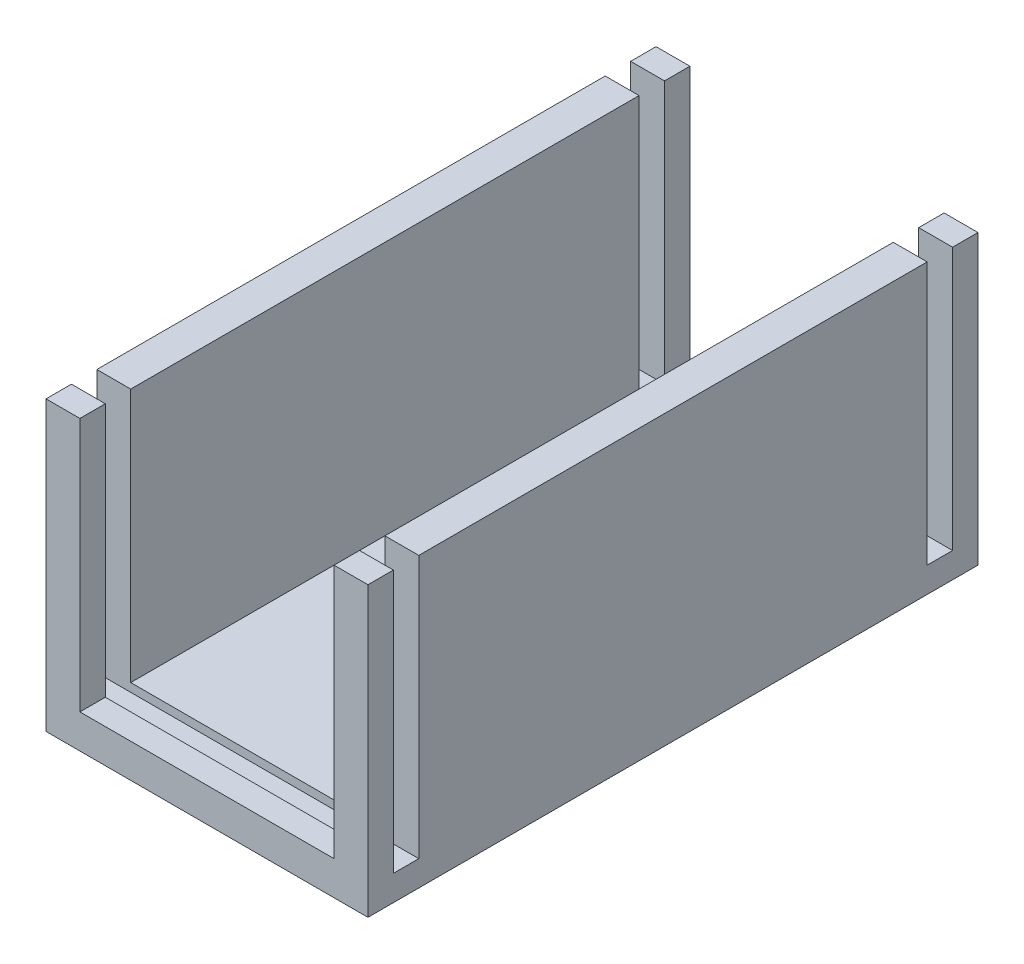
ISO-10303-21;
HEADER;
FILE_DESCRIPTION(('STEP AP214'),'2;1');
FILE_NAME('part.step','',(''),(''),'','','');
FILE_SCHEMA(('AUTOMOTIVE_DESIGN { 1 0 10303 214 1 1 1 1 }'));
ENDSEC;
DATA;
#1=APPLICATION_CONTEXT('core data for automotive mechanical design processes');
#2=APPLICATION_PROTOCOL_DEFINITION('international standard','automotive_design',2000,#1);
#3=PRODUCT_CONTEXT('',#1,'mechanical');
#4=PRODUCT('Part','Part','',(#3));
#5=PRODUCT_RELATED_PRODUCT_CATEGORY('part','',(#4));
#6=PRODUCT_DEFINITION_FORMATION('','',#4);
#7=PRODUCT_DEFINITION_CONTEXT('part definition',#1,'design');
#8=PRODUCT_DEFINITION('design','',#6,#7);
#9=PRODUCT_DEFINITION_SHAPE('','',#8);
#10=(LENGTH_UNIT() NAMED_UNIT(*) SI_UNIT(.MILLI.,.METRE.));
#11=(NAMED_UNIT(*) PLANE_ANGLE_UNIT() SI_UNIT($,.RADIAN.));
#12=(NAMED_UNIT(*) SI_UNIT($,.STERADIAN.) SOLID_ANGLE_UNIT());
#13=UNCERTAINTY_MEASURE_WITH_UNIT(LENGTH_MEASURE(1.E-05),#10,'distance_accuracy_value','');
#14=(GEOMETRIC_REPRESENTATION_CONTEXT(3) GLOBAL_UNCERTAINTY_ASSIGNED_CONTEXT((#13)) GLOBAL_UNIT_ASSIGNED_CONTEXT((#10,
#11,#12)) REPRESENTATION_CONTEXT('',''));
#15=CARTESIAN_POINT('',(0.,0.,0.));
#16=DIRECTION('',(0.,0.,1.));
#17=DIRECTION('',(1.,0.,0.));
#18=AXIS2_PLACEMENT_3D('',#15,#16,#17);
#19=CARTESIAN_POINT('',(9.5,8.5,36.));
#20=DIRECTION('',(0.,-1.,0.));
#21=DIRECTION('',(0.,0.,-1.));
#22=AXIS2_PLACEMENT_3D('',#19,#20,#21);
#23=PLANE('',#22);
#24=DIRECTION('',(0.,0.,-1.));
#25=VECTOR('',#24,1.);
#26=CARTESIAN_POINT('',(-9.5,8.5,36.));
#27=LINE('',#26,#25);
#28=CARTESIAN_POINT('',(-9.5,8.5,1.5));
#29=VERTEX_POINT('',#28);
#30=CARTESIAN_POINT('',(-9.5,8.5,0.));
#31=VERTEX_POINT('',#30);
#32=EDGE_CURVE('E323',#29,#31,#27,.T.);
#33=ORIENTED_EDGE('',*,*,#32,.F.);
#34=DIRECTION('',(-1.,0.,0.));
#35=VECTOR('',#34,1.);
#36=CARTESIAN_POINT('',(-9.5,8.5,1.5));
#37=LINE('',#36,#35);
#38=CARTESIAN_POINT('',(-7.5,8.5,1.5));
#39=VERTEX_POINT('',#38);
#40=EDGE_CURVE('E419',#39,#29,#37,.T.);
#41=ORIENTED_EDGE('',*,*,#40,.F.);
#42=DIRECTION('',(0.,0.,1.));
#43=VECTOR('',#42,1.);
#44=CARTESIAN_POINT('',(-7.5,8.5,36.));
#45=LINE('',#44,#43);
#46=CARTESIAN_POINT('',(-7.5,8.5,0.));
#47=VERTEX_POINT('',#46);
#48=EDGE_CURVE('E292',#47,#39,#45,.T.);
#49=ORIENTED_EDGE('',*,*,#48,.F.);
#50=DIRECTION('',(-1.,0.,0.));
#51=VECTOR('',#50,1.);
#52=CARTESIAN_POINT('',(9.5,8.5,0.));
#53=LINE('',#52,#51);
#54=EDGE_CURVE('E331',#47,#31,#53,.T.);
#55=ORIENTED_EDGE('',*,*,#54,.T.);
#56=EDGE_LOOP('',(#33,#41,#49,#55));
#57=FACE_BOUND('',#56,.T.);
#58=ADVANCED_FACE('F33',(#57),#23,.F.);
#59=DIRECTION('',(0.,0.,-1.));
#60=VECTOR('',#59,1.);
#61=CARTESIAN_POINT('',(7.5,8.5,36.));
#62=LINE('',#61,#60);
#63=CARTESIAN_POINT('',(7.5,8.5,1.5));
#64=VERTEX_POINT('',#63);
#65=CARTESIAN_POINT('',(7.5,8.5,0.));
#66=VERTEX_POINT('',#65);
#67=EDGE_CURVE('E295',#64,#66,#62,.T.);
#68=ORIENTED_EDGE('',*,*,#67,.F.);
#69=CARTESIAN_POINT('',(9.5,8.5,1.5));
#70=VERTEX_POINT('',#69);
#71=EDGE_CURVE('E209',#70,#64,#37,.T.);
#72=ORIENTED_EDGE('',*,*,#71,.F.);
#73=DIRECTION('',(0.,0.,-1.));
#74=VECTOR('',#73,1.);
#75=CARTESIAN_POINT('',(9.5,8.5,36.));
#76=LINE('',#75,#74);
#77=CARTESIAN_POINT('',(9.5,8.5,0.));
#78=VERTEX_POINT('',#77);
#79=EDGE_CURVE('E337',#70,#78,#76,.T.);
#80=ORIENTED_EDGE('',*,*,#79,.T.);
#81=EDGE_CURVE('E315',#78,#66,#53,.T.);
#82=ORIENTED_EDGE('',*,*,#81,.T.);
#83=EDGE_LOOP('',(#68,#72,#80,#82));
#84=FACE_BOUND('',#83,.T.);
#85=ADVANCED_FACE('F431',(#84),#23,.F.);
#86=CARTESIAN_POINT('',(-7.5,-6.5,36.));
#87=DIRECTION('',(-1.,0.,0.));
#88=DIRECTION('',(0.,0.,1.));
#89=AXIS2_PLACEMENT_3D('',#86,#87,#88);
#90=PLANE('',#89);
#91=ORIENTED_EDGE('',*,*,#48,.T.);
#92=DIRECTION('',(0.,-1.,0.));
#93=VECTOR('',#92,1.);
#94=CARTESIAN_POINT('',(-7.5,-6.5,1.5));
#95=LINE('',#94,#93);
#96=CARTESIAN_POINT('',(-7.5,-6.5,1.5));
#97=VERTEX_POINT('',#96);
#98=EDGE_CURVE('E235',#39,#97,#95,.T.);
#99=ORIENTED_EDGE('',*,*,#98,.T.);
#100=DIRECTION('',(0.,0.,1.));
#101=VECTOR('',#100,1.);
#102=CARTESIAN_POINT('',(-7.5,-6.5,36.));
#103=LINE('',#102,#101);
#104=CARTESIAN_POINT('',(-7.5,-6.5,0.));
#105=VERTEX_POINT('',#104);
#106=EDGE_CURVE('E275',#105,#97,#103,.T.);
#107=ORIENTED_EDGE('',*,*,#106,.F.);
#108=DIRECTION('',(0.,1.,0.));
#109=VECTOR('',#108,1.);
#110=CARTESIAN_POINT('',(-7.5,-6.5,0.));
#111=LINE('',#110,#109);
#112=EDGE_CURVE('E301',#105,#47,#111,.T.);
#113=ORIENTED_EDGE('',*,*,#112,.T.);
#114=EDGE_LOOP('',(#91,#99,#107,#113));
#115=FACE_BOUND('',#114,.T.);
#116=ADVANCED_FACE('F449',(#115),#90,.F.);
#117=CARTESIAN_POINT('',(7.5,-6.5,36.));
#118=DIRECTION('',(1.,0.,0.));
#119=DIRECTION('',(0.,0.,-1.));
#120=AXIS2_PLACEMENT_3D('',#117,#118,#119);
#121=PLANE('',#120);
#122=DIRECTION('',(0.,0.,-1.));
#123=VECTOR('',#122,1.);
#124=CARTESIAN_POINT('',(7.5,-6.5,36.));
#125=LINE('',#124,#123);
#126=CARTESIAN_POINT('',(7.5,-6.5,1.5));
#127=VERTEX_POINT('',#126);
#128=CARTESIAN_POINT('',(7.5,-6.5,0.));
#129=VERTEX_POINT('',#128);
#130=EDGE_CURVE('E283',#127,#129,#125,.T.);
#131=ORIENTED_EDGE('',*,*,#130,.F.);
#132=DIRECTION('',(0.,1.,0.));
#133=VECTOR('',#132,1.);
#134=CARTESIAN_POINT('',(7.5,-6.5,1.5));
#135=LINE('',#134,#133);
#136=EDGE_CURVE('E232',#127,#64,#135,.T.);
#137=ORIENTED_EDGE('',*,*,#136,.T.);
#138=ORIENTED_EDGE('',*,*,#67,.T.);
#139=DIRECTION('',(0.,1.,0.));
#140=VECTOR('',#139,1.);
#141=CARTESIAN_POINT('',(7.5,-6.5,0.));
#142=LINE('',#141,#140);
#143=EDGE_CURVE('E304',#129,#66,#142,.T.);
#144=ORIENTED_EDGE('',*,*,#143,.F.);
#145=EDGE_LOOP('',(#131,#137,#138,#144));
#146=FACE_BOUND('',#145,.T.);
#147=ADVANCED_FACE('F447',(#146),#121,.F.);
#148=CARTESIAN_POINT('',(0.,-6.5,0.));
#149=DIRECTION('',(0.,1.,0.));
#150=DIRECTION('',(0.,0.,1.));
#151=AXIS2_PLACEMENT_3D('',#148,#149,#150);
#152=PLANE('',#151);
#153=DIRECTION('',(-1.,0.,0.));
#154=VECTOR('',#153,1.);
#155=CARTESIAN_POINT('',(0.,-6.5,1.5));
#156=LINE('',#155,#154);
#157=EDGE_CURVE('E230',#127,#97,#156,.T.);
#158=ORIENTED_EDGE('',*,*,#157,.F.);
#159=ORIENTED_EDGE('',*,*,#130,.T.);
#160=DIRECTION('',(-1.,0.,0.));
#161=VECTOR('',#160,1.);
#162=CARTESIAN_POINT('',(7.5,-6.5,0.));
#163=LINE('',#162,#161);
#164=EDGE_CURVE('E287',#129,#105,#163,.T.);
#165=ORIENTED_EDGE('',*,*,#164,.T.);
#166=ORIENTED_EDGE('',*,*,#106,.T.);
#167=EDGE_LOOP('',(#158,#159,#165,#166));
#168=FACE_BOUND('',#167,.T.);
#169=ADVANCED_FACE('F444',(#168),#152,.T.);
#170=CARTESIAN_POINT('',(-7.5,8.5,3.));
#171=VERTEX_POINT('',#170);
#172=CARTESIAN_POINT('',(-7.5,8.5,33.));
#173=VERTEX_POINT('',#172);
#174=EDGE_CURVE('E296',#171,#173,#45,.T.);
#175=ORIENTED_EDGE('',*,*,#174,.F.);
#176=DIRECTION('',(1.,0.,0.));
#177=VECTOR('',#176,1.);
#178=CARTESIAN_POINT('',(-9.5,8.5,3.));
#179=LINE('',#178,#177);
#180=CARTESIAN_POINT('',(-9.5,8.5,3.));
#181=VERTEX_POINT('',#180);
#182=EDGE_CURVE('E384',#181,#171,#179,.T.);
#183=ORIENTED_EDGE('',*,*,#182,.F.);
#184=CARTESIAN_POINT('',(-9.5,8.5,33.));
#185=VERTEX_POINT('',#184);
#186=EDGE_CURVE('E214',#185,#181,#27,.T.);
#187=ORIENTED_EDGE('',*,*,#186,.F.);
#188=DIRECTION('',(-1.,0.,0.));
#189=VECTOR('',#188,1.);
#190=CARTESIAN_POINT('',(-9.5,8.5,33.));
#191=LINE('',#190,#189);
#192=EDGE_CURVE('E254',#173,#185,#191,.T.);
#193=ORIENTED_EDGE('',*,*,#192,.F.);
#194=EDGE_LOOP('',(#175,#183,#187,#193));
#195=FACE_BOUND('',#194,.T.);
#196=ADVANCED_FACE('F383',(#195),#23,.F.);
#197=CARTESIAN_POINT('',(9.5,8.5,33.));
#198=VERTEX_POINT('',#197);
#199=CARTESIAN_POINT('',(9.5,8.5,3.));
#200=VERTEX_POINT('',#199);
#201=EDGE_CURVE('E342',#198,#200,#76,.T.);
#202=ORIENTED_EDGE('',*,*,#201,.T.);
#203=CARTESIAN_POINT('',(7.5,8.5,3.));
#204=VERTEX_POINT('',#203);
#205=EDGE_CURVE('E420',#204,#200,#179,.T.);
#206=ORIENTED_EDGE('',*,*,#205,.F.);
#207=CARTESIAN_POINT('',(7.5,8.5,33.));
#208=VERTEX_POINT('',#207);
#209=EDGE_CURVE('E300',#208,#204,#62,.T.);
#210=ORIENTED_EDGE('',*,*,#209,.F.);
#211=EDGE_CURVE('E243',#198,#208,#191,.T.);
#212=ORIENTED_EDGE('',*,*,#211,.F.);
#213=EDGE_LOOP('',(#202,#206,#210,#212));
#214=FACE_BOUND('',#213,.T.);
#215=ADVANCED_FACE('F435',(#214),#23,.F.);
#216=CARTESIAN_POINT('',(-7.5,-6.5,3.));
#217=VERTEX_POINT('',#216);
#218=CARTESIAN_POINT('',(-7.5,-6.5,33.));
#219=VERTEX_POINT('',#218);
#220=EDGE_CURVE('E279',#217,#219,#103,.T.);
#221=ORIENTED_EDGE('',*,*,#220,.F.);
#222=DIRECTION('',(0.,1.,0.));
#223=VECTOR('',#222,1.);
#224=CARTESIAN_POINT('',(-7.5,-6.5,3.));
#225=LINE('',#224,#223);
#226=EDGE_CURVE('E227',#217,#171,#225,.T.);
#227=ORIENTED_EDGE('',*,*,#226,.T.);
#228=ORIENTED_EDGE('',*,*,#174,.T.);
#229=DIRECTION('',(0.,-1.,0.));
#230=VECTOR('',#229,1.);
#231=CARTESIAN_POINT('',(-7.5,-6.5,33.));
#232=LINE('',#231,#230);
#233=EDGE_CURVE('E271',#173,#219,#232,.T.);
#234=ORIENTED_EDGE('',*,*,#233,.T.);
#235=EDGE_LOOP('',(#221,#227,#228,#234));
#236=FACE_BOUND('',#235,.T.);
#237=ADVANCED_FACE('F418',(#236),#90,.F.);
#238=ORIENTED_EDGE('',*,*,#209,.T.);
#239=DIRECTION('',(0.,-1.,0.));
#240=VECTOR('',#239,1.);
#241=CARTESIAN_POINT('',(7.5,-6.5,3.));
#242=LINE('',#241,#240);
#243=CARTESIAN_POINT('',(7.5,-6.5,3.));
#244=VERTEX_POINT('',#243);
#245=EDGE_CURVE('E223',#204,#244,#242,.T.);
#246=ORIENTED_EDGE('',*,*,#245,.T.);
#247=CARTESIAN_POINT('',(7.5,-6.5,33.));
#248=VERTEX_POINT('',#247);
#249=EDGE_CURVE('E288',#248,#244,#125,.T.);
#250=ORIENTED_EDGE('',*,*,#249,.F.);
#251=DIRECTION('',(0.,1.,0.));
#252=VECTOR('',#251,1.);
#253=CARTESIAN_POINT('',(7.5,-6.5,33.));
#254=LINE('',#253,#252);
#255=EDGE_CURVE('E268',#248,#208,#254,.T.);
#256=ORIENTED_EDGE('',*,*,#255,.T.);
#257=EDGE_LOOP('',(#238,#246,#250,#256));
#258=FACE_BOUND('',#257,.T.);
#259=ADVANCED_FACE('F439',(#258),#121,.F.);
#260=DIRECTION('',(1.,0.,0.));
#261=VECTOR('',#260,1.);
#262=CARTESIAN_POINT('',(0.,-6.5,3.));
#263=LINE('',#262,#261);
#264=EDGE_CURVE('E221',#217,#244,#263,.T.);
#265=ORIENTED_EDGE('',*,*,#264,.F.);
#266=ORIENTED_EDGE('',*,*,#220,.T.);
#267=DIRECTION('',(-1.,0.,0.));
#268=VECTOR('',#267,1.);
#269=CARTESIAN_POINT('',(0.,-6.5,33.));
#270=LINE('',#269,#268);
#271=EDGE_CURVE('E11',#248,#219,#270,.T.);
#272=ORIENTED_EDGE('',*,*,#271,.F.);
#273=ORIENTED_EDGE('',*,*,#249,.T.);
#274=EDGE_LOOP('',(#265,#266,#272,#273));
#275=FACE_BOUND('',#274,.T.);
#276=ADVANCED_FACE('F414',(#275),#152,.T.);
#277=CARTESIAN_POINT('',(-7.5,8.5,34.5));
#278=VERTEX_POINT('',#277);
#279=CARTESIAN_POINT('',(-7.5,8.5,36.));
#280=VERTEX_POINT('',#279);
#281=EDGE_CURVE('E274',#278,#280,#45,.T.);
#282=ORIENTED_EDGE('',*,*,#281,.F.);
#283=DIRECTION('',(1.,0.,0.));
#284=VECTOR('',#283,1.);
#285=CARTESIAN_POINT('',(-9.5,8.5,34.5));
#286=LINE('',#285,#284);
#287=CARTESIAN_POINT('',(-9.5,8.5,34.5));
#288=VERTEX_POINT('',#287);
#289=EDGE_CURVE('E252',#288,#278,#286,.T.);
#290=ORIENTED_EDGE('',*,*,#289,.F.);
#291=CARTESIAN_POINT('',(-9.5,8.5,36.));
#292=VERTEX_POINT('',#291);
#293=EDGE_CURVE('E334',#292,#288,#27,.T.);
#294=ORIENTED_EDGE('',*,*,#293,.F.);
#295=DIRECTION('',(-1.,0.,0.));
#296=VECTOR('',#295,1.);
#297=CARTESIAN_POINT('',(9.5,8.5,36.));
#298=LINE('',#297,#296);
#299=EDGE_CURVE('E319',#280,#292,#298,.T.);
#300=ORIENTED_EDGE('',*,*,#299,.F.);
#301=EDGE_LOOP('',(#282,#290,#294,#300));
#302=FACE_BOUND('',#301,.T.);
#303=ADVANCED_FACE('F407',(#302),#23,.F.);
#304=CARTESIAN_POINT('',(-9.5,-8.5,36.));
#305=DIRECTION('',(1.,0.,0.));
#306=DIRECTION('',(0.,0.,-1.));
#307=AXIS2_PLACEMENT_3D('',#304,#305,#306);
#308=PLANE('',#307);
#309=DIRECTION('',(0.,0.,1.));
#310=VECTOR('',#309,1.);
#311=CARTESIAN_POINT('',(-9.5,-7.,1.5));
#312=LINE('',#311,#310);
#313=CARTESIAN_POINT('',(-9.5,-7.,1.5));
#314=VERTEX_POINT('',#313);
#315=CARTESIAN_POINT('',(-9.5,-7.,3.));
#316=VERTEX_POINT('',#315);
#317=EDGE_CURVE('E200',#314,#316,#312,.T.);
#318=ORIENTED_EDGE('',*,*,#317,.F.);
#319=DIRECTION('',(0.,1.,0.));
#320=VECTOR('',#319,1.);
#321=CARTESIAN_POINT('',(-9.5,-7.,1.5));
#322=LINE('',#321,#320);
#323=EDGE_CURVE('E224',#314,#29,#322,.T.);
#324=ORIENTED_EDGE('',*,*,#323,.T.);
#325=ORIENTED_EDGE('',*,*,#32,.T.);
#326=DIRECTION('',(0.,-1.,0.));
#327=VECTOR('',#326,1.);
#328=CARTESIAN_POINT('',(-9.5,-8.5,0.));
#329=LINE('',#328,#327);
#330=CARTESIAN_POINT('',(-9.5,-8.5,0.));
#331=VERTEX_POINT('',#330);
#332=EDGE_CURVE('E303',#31,#331,#329,.T.);
#333=ORIENTED_EDGE('',*,*,#332,.T.);
#334=DIRECTION('',(0.,0.,-1.));
#335=VECTOR('',#334,1.);
#336=CARTESIAN_POINT('',(-9.5,-8.5,36.));
#337=LINE('',#336,#335);
#338=CARTESIAN_POINT('',(-9.5,-8.5,36.));
#339=VERTEX_POINT('',#338);
#340=EDGE_CURVE('E345',#339,#331,#337,.T.);
#341=ORIENTED_EDGE('',*,*,#340,.F.);
#342=DIRECTION('',(0.,-1.,0.));
#343=VECTOR('',#342,1.);
#344=CARTESIAN_POINT('',(-9.5,-8.5,36.));
#345=LINE('',#344,#343);
#346=EDGE_CURVE('E311',#292,#339,#345,.T.);
#347=ORIENTED_EDGE('',*,*,#346,.F.);
#348=ORIENTED_EDGE('',*,*,#293,.T.);
#349=DIRECTION('',(0.,1.,0.));
#350=VECTOR('',#349,1.);
#351=CARTESIAN_POINT('',(-9.5,-7.,34.5));
#352=LINE('',#351,#350);
#353=CARTESIAN_POINT('',(-9.5,-7.,34.5));
#354=VERTEX_POINT('',#353);
#355=EDGE_CURVE('E251',#354,#288,#352,.T.);
#356=ORIENTED_EDGE('',*,*,#355,.F.);
#357=DIRECTION('',(0.,0.,1.));
#358=VECTOR('',#357,1.);
#359=CARTESIAN_POINT('',(-9.5,-7.,34.5));
#360=LINE('',#359,#358);
#361=CARTESIAN_POINT('',(-9.5,-7.,33.));
#362=VERTEX_POINT('',#361);
#363=EDGE_CURVE('E239',#362,#354,#360,.T.);
#364=ORIENTED_EDGE('',*,*,#363,.F.);
#365=DIRECTION('',(0.,1.,0.));
#366=VECTOR('',#365,1.);
#367=CARTESIAN_POINT('',(-9.5,-7.,33.));
#368=LINE('',#367,#366);
#369=EDGE_CURVE('E256',#362,#185,#368,.T.);
#370=ORIENTED_EDGE('',*,*,#369,.T.);
#371=ORIENTED_EDGE('',*,*,#186,.T.);
#372=DIRECTION('',(0.,1.,0.));
#373=VECTOR('',#372,1.);
#374=CARTESIAN_POINT('',(-9.5,-7.,3.));
#375=LINE('',#374,#373);
#376=EDGE_CURVE('E194',#316,#181,#375,.T.);
#377=ORIENTED_EDGE('',*,*,#376,.F.);
#378=EDGE_LOOP('',(#318,#324,#325,#333,#341,#347,#348,#356,#364,#370,#371,#377));
#379=FACE_BOUND('',#378,.T.);
#380=ADVANCED_FACE('F35',(#379),#308,.F.);
#381=CARTESIAN_POINT('',(9.5,-8.5,36.));
#382=DIRECTION('',(0.,1.,0.));
#383=DIRECTION('',(-1.,0.,0.));
#384=AXIS2_PLACEMENT_3D('',#381,#382,#383);
#385=PLANE('',#384);
#386=DIRECTION('',(1.,0.,0.));
#387=VECTOR('',#386,1.);
#388=CARTESIAN_POINT('',(9.5,-8.5,0.));
#389=LINE('',#388,#387);
#390=CARTESIAN_POINT('',(9.5,-8.5,0.));
#391=VERTEX_POINT('',#390);
#392=EDGE_CURVE('E326',#331,#391,#389,.T.);
#393=ORIENTED_EDGE('',*,*,#392,.T.);
#394=DIRECTION('',(0.,0.,-1.));
#395=VECTOR('',#394,1.);
#396=CARTESIAN_POINT('',(9.5,-8.5,36.));
#397=LINE('',#396,#395);
#398=CARTESIAN_POINT('',(9.5,-8.5,36.));
#399=VERTEX_POINT('',#398);
#400=EDGE_CURVE('E341',#399,#391,#397,.T.);
#401=ORIENTED_EDGE('',*,*,#400,.F.);
#402=DIRECTION('',(1.,0.,0.));
#403=VECTOR('',#402,1.);
#404=CARTESIAN_POINT('',(9.5,-8.5,36.));
#405=LINE('',#404,#403);
#406=EDGE_CURVE('E314',#339,#399,#405,.T.);
#407=ORIENTED_EDGE('',*,*,#406,.F.);
#408=ORIENTED_EDGE('',*,*,#340,.T.);
#409=EDGE_LOOP('',(#393,#401,#407,#408));
#410=FACE_BOUND('',#409,.T.);
#411=ADVANCED_FACE('F400',(#410),#385,.F.);
#412=CARTESIAN_POINT('',(9.5,-8.5,36.));
#413=DIRECTION('',(-1.,0.,0.));
#414=DIRECTION('',(0.,0.,1.));
#415=AXIS2_PLACEMENT_3D('',#412,#413,#414);
#416=PLANE('',#415);
#417=ORIENTED_EDGE('',*,*,#79,.F.);
#418=DIRECTION('',(0.,1.,0.));
#419=VECTOR('',#418,1.);
#420=CARTESIAN_POINT('',(9.5,-7.,1.5));
#421=LINE('',#420,#419);
#422=CARTESIAN_POINT('',(9.5,-7.,1.5));
#423=VERTEX_POINT('',#422);
#424=EDGE_CURVE('E216',#423,#70,#421,.T.);
#425=ORIENTED_EDGE('',*,*,#424,.F.);
#426=DIRECTION('',(0.,0.,-1.));
#427=VECTOR('',#426,1.);
#428=CARTESIAN_POINT('',(9.5,-7.,1.5));
#429=LINE('',#428,#427);
#430=CARTESIAN_POINT('',(9.5,-7.,3.));
#431=VERTEX_POINT('',#430);
#432=EDGE_CURVE('E199',#431,#423,#429,.T.);
#433=ORIENTED_EDGE('',*,*,#432,.F.);
#434=DIRECTION('',(0.,1.,0.));
#435=VECTOR('',#434,1.);
#436=CARTESIAN_POINT('',(9.5,-7.,3.));
#437=LINE('',#436,#435);
#438=EDGE_CURVE('E197',#431,#200,#437,.T.);
#439=ORIENTED_EDGE('',*,*,#438,.T.);
#440=ORIENTED_EDGE('',*,*,#201,.F.);
#441=DIRECTION('',(0.,1.,0.));
#442=VECTOR('',#441,1.);
#443=CARTESIAN_POINT('',(9.5,-7.,33.));
#444=LINE('',#443,#442);
#445=CARTESIAN_POINT('',(9.5,-7.,33.));
#446=VERTEX_POINT('',#445);
#447=EDGE_CURVE('E259',#446,#198,#444,.T.);
#448=ORIENTED_EDGE('',*,*,#447,.F.);
#449=DIRECTION('',(0.,0.,-1.));
#450=VECTOR('',#449,1.);
#451=CARTESIAN_POINT('',(9.5,-7.,34.5));
#452=LINE('',#451,#450);
#453=CARTESIAN_POINT('',(9.5,-7.,34.5));
#454=VERTEX_POINT('',#453);
#455=EDGE_CURVE('E246',#454,#446,#452,.T.);
#456=ORIENTED_EDGE('',*,*,#455,.F.);
#457=DIRECTION('',(0.,1.,0.));
#458=VECTOR('',#457,1.);
#459=CARTESIAN_POINT('',(9.5,-7.,34.5));
#460=LINE('',#459,#458);
#461=CARTESIAN_POINT('',(9.5,8.5,34.5));
#462=VERTEX_POINT('',#461);
#463=EDGE_CURVE('E261',#454,#462,#460,.T.);
#464=ORIENTED_EDGE('',*,*,#463,.T.);
#465=CARTESIAN_POINT('',(9.5,8.5,36.));
#466=VERTEX_POINT('',#465);
#467=EDGE_CURVE('E338',#466,#462,#76,.T.);
#468=ORIENTED_EDGE('',*,*,#467,.F.);
#469=DIRECTION('',(0.,1.,0.));
#470=VECTOR('',#469,1.);
#471=CARTESIAN_POINT('',(9.5,-8.5,36.));
#472=LINE('',#471,#470);
#473=EDGE_CURVE('E317',#399,#466,#472,.T.);
#474=ORIENTED_EDGE('',*,*,#473,.F.);
#475=ORIENTED_EDGE('',*,*,#400,.T.);
#476=DIRECTION('',(0.,1.,0.));
#477=VECTOR('',#476,1.);
#478=CARTESIAN_POINT('',(9.5,-8.5,0.));
#479=LINE('',#478,#477);
#480=EDGE_CURVE('E328',#391,#78,#479,.T.);
#481=ORIENTED_EDGE('',*,*,#480,.T.);
#482=EDGE_LOOP('',(#417,#425,#433,#439,#440,#448,#456,#464,#468,#474,#475,#481));
#483=FACE_BOUND('',#482,.T.);
#484=ADVANCED_FACE('F367',(#483),#416,.F.);
#485=ORIENTED_EDGE('',*,*,#467,.T.);
#486=CARTESIAN_POINT('',(7.5,8.5,34.5));
#487=VERTEX_POINT('',#486);
#488=EDGE_CURVE('E238',#487,#462,#286,.T.);
#489=ORIENTED_EDGE('',*,*,#488,.F.);
#490=CARTESIAN_POINT('',(7.5,8.5,36.));
#491=VERTEX_POINT('',#490);
#492=EDGE_CURVE('E297',#491,#487,#62,.T.);
#493=ORIENTED_EDGE('',*,*,#492,.F.);
#494=EDGE_CURVE('E320',#466,#491,#298,.T.);
#495=ORIENTED_EDGE('',*,*,#494,.F.);
#496=EDGE_LOOP('',(#485,#489,#493,#495));
#497=FACE_BOUND('',#496,.T.);
#498=ADVANCED_FACE('F362',(#497),#23,.F.);
#499=CARTESIAN_POINT('',(0.,0.,36.));
#500=DIRECTION('',(0.,0.,1.));
#501=DIRECTION('',(1.,0.,0.));
#502=AXIS2_PLACEMENT_3D('',#499,#500,#501);
#503=PLANE('',#502);
#504=DIRECTION('',(0.,1.,0.));
#505=VECTOR('',#504,1.);
#506=CARTESIAN_POINT('',(-7.5,-6.5,36.));
#507=LINE('',#506,#505);
#508=CARTESIAN_POINT('',(-7.5,-6.5,36.));
#509=VERTEX_POINT('',#508);
#510=EDGE_CURVE('E291',#509,#280,#507,.T.);
#511=ORIENTED_EDGE('',*,*,#510,.T.);
#512=ORIENTED_EDGE('',*,*,#299,.T.);
#513=ORIENTED_EDGE('',*,*,#346,.T.);
#514=ORIENTED_EDGE('',*,*,#406,.T.);
#515=ORIENTED_EDGE('',*,*,#473,.T.);
#516=ORIENTED_EDGE('',*,*,#494,.T.);
#517=DIRECTION('',(0.,1.,0.));
#518=VECTOR('',#517,1.);
#519=CARTESIAN_POINT('',(7.5,-6.5,36.));
#520=LINE('',#519,#518);
#521=CARTESIAN_POINT('',(7.5,-6.5,36.));
#522=VERTEX_POINT('',#521);
#523=EDGE_CURVE('E307',#522,#491,#520,.T.);
#524=ORIENTED_EDGE('',*,*,#523,.F.);
#525=DIRECTION('',(1.,0.,0.));
#526=VECTOR('',#525,1.);
#527=CARTESIAN_POINT('',(7.5,-6.5,36.));
#528=LINE('',#527,#526);
#529=EDGE_CURVE('E278',#509,#522,#528,.T.);
#530=ORIENTED_EDGE('',*,*,#529,.F.);
#531=EDGE_LOOP('',(#511,#512,#513,#514,#515,#516,#524,#530));
#532=FACE_BOUND('',#531,.T.);
#533=ADVANCED_FACE('F359',(#532),#503,.T.);
#534=CARTESIAN_POINT('',(0.,0.,0.));
#535=DIRECTION('',(0.,0.,1.));
#536=DIRECTION('',(1.,0.,0.));
#537=AXIS2_PLACEMENT_3D('',#534,#535,#536);
#538=PLANE('',#537);
#539=ORIENTED_EDGE('',*,*,#54,.F.);
#540=ORIENTED_EDGE('',*,*,#112,.F.);
#541=ORIENTED_EDGE('',*,*,#164,.F.);
#542=ORIENTED_EDGE('',*,*,#143,.T.);
#543=ORIENTED_EDGE('',*,*,#81,.F.);
#544=ORIENTED_EDGE('',*,*,#480,.F.);
#545=ORIENTED_EDGE('',*,*,#392,.F.);
#546=ORIENTED_EDGE('',*,*,#332,.F.);
#547=EDGE_LOOP('',(#539,#540,#541,#542,#543,#544,#545,#546));
#548=FACE_BOUND('',#547,.T.);
#549=ADVANCED_FACE('F395',(#548),#538,.F.);
#550=CARTESIAN_POINT('',(-7.5,-6.5,34.5));
#551=VERTEX_POINT('',#550);
#552=EDGE_CURVE('E280',#551,#509,#103,.T.);
#553=ORIENTED_EDGE('',*,*,#552,.F.);
#554=DIRECTION('',(0.,1.,0.));
#555=VECTOR('',#554,1.);
#556=CARTESIAN_POINT('',(-7.5,-6.5,34.5));
#557=LINE('',#556,#555);
#558=EDGE_CURVE('E56',#551,#278,#557,.T.);
#559=ORIENTED_EDGE('',*,*,#558,.T.);
#560=ORIENTED_EDGE('',*,*,#281,.T.);
#561=ORIENTED_EDGE('',*,*,#510,.F.);
#562=EDGE_LOOP('',(#553,#559,#560,#561));
#563=FACE_BOUND('',#562,.T.);
#564=ADVANCED_FACE('F409',(#563),#90,.F.);
#565=ORIENTED_EDGE('',*,*,#492,.T.);
#566=DIRECTION('',(0.,-1.,0.));
#567=VECTOR('',#566,1.);
#568=CARTESIAN_POINT('',(7.5,-6.5,34.5));
#569=LINE('',#568,#567);
#570=CARTESIAN_POINT('',(7.5,-6.5,34.5));
#571=VERTEX_POINT('',#570);
#572=EDGE_CURVE('E258',#487,#571,#569,.T.);
#573=ORIENTED_EDGE('',*,*,#572,.T.);
#574=EDGE_CURVE('E284',#522,#571,#125,.T.);
#575=ORIENTED_EDGE('',*,*,#574,.F.);
#576=ORIENTED_EDGE('',*,*,#523,.T.);
#577=EDGE_LOOP('',(#565,#573,#575,#576));
#578=FACE_BOUND('',#577,.T.);
#579=ADVANCED_FACE('F352',(#578),#121,.F.);
#580=DIRECTION('',(1.,0.,0.));
#581=VECTOR('',#580,1.);
#582=CARTESIAN_POINT('',(0.,-6.5,34.5));
#583=LINE('',#582,#581);
#584=EDGE_CURVE('E41',#551,#571,#583,.T.);
#585=ORIENTED_EDGE('',*,*,#584,.F.);
#586=ORIENTED_EDGE('',*,*,#552,.T.);
#587=ORIENTED_EDGE('',*,*,#529,.T.);
#588=ORIENTED_EDGE('',*,*,#574,.T.);
#589=EDGE_LOOP('',(#585,#586,#587,#588));
#590=FACE_BOUND('',#589,.T.);
#591=ADVANCED_FACE('F354',(#590),#152,.T.);
#592=CARTESIAN_POINT('',(-9.5,-7.,33.));
#593=DIRECTION('',(0.,0.,-1.));
#594=DIRECTION('',(-1.,0.,0.));
#595=AXIS2_PLACEMENT_3D('',#592,#593,#594);
#596=PLANE('',#595);
#597=ORIENTED_EDGE('',*,*,#192,.T.);
#598=ORIENTED_EDGE('',*,*,#369,.F.);
#599=DIRECTION('',(-1.,0.,0.));
#600=VECTOR('',#599,1.);
#601=CARTESIAN_POINT('',(-9.5,-7.,33.));
#602=LINE('',#601,#600);
#603=EDGE_CURVE('E248',#446,#362,#602,.T.);
#604=ORIENTED_EDGE('',*,*,#603,.F.);
#605=ORIENTED_EDGE('',*,*,#447,.T.);
#606=ORIENTED_EDGE('',*,*,#211,.T.);
#607=ORIENTED_EDGE('',*,*,#255,.F.);
#608=ORIENTED_EDGE('',*,*,#271,.T.);
#609=ORIENTED_EDGE('',*,*,#233,.F.);
#610=EDGE_LOOP('',(#597,#598,#604,#605,#606,#607,#608,#609));
#611=FACE_BOUND('',#610,.T.);
#612=ADVANCED_FACE('F376',(#611),#596,.F.);
#613=CARTESIAN_POINT('',(-9.5,-7.,34.5));
#614=DIRECTION('',(0.,0.,1.));
#615=DIRECTION('',(1.,0.,0.));
#616=AXIS2_PLACEMENT_3D('',#613,#614,#615);
#617=PLANE('',#616);
#618=ORIENTED_EDGE('',*,*,#584,.T.);
#619=ORIENTED_EDGE('',*,*,#572,.F.);
#620=ORIENTED_EDGE('',*,*,#488,.T.);
#621=ORIENTED_EDGE('',*,*,#463,.F.);
#622=DIRECTION('',(1.,0.,0.));
#623=VECTOR('',#622,1.);
#624=CARTESIAN_POINT('',(-9.5,-7.,34.5));
#625=LINE('',#624,#623);
#626=EDGE_CURVE('E242',#354,#454,#625,.T.);
#627=ORIENTED_EDGE('',*,*,#626,.F.);
#628=ORIENTED_EDGE('',*,*,#355,.T.);
#629=ORIENTED_EDGE('',*,*,#289,.T.);
#630=ORIENTED_EDGE('',*,*,#558,.F.);
#631=EDGE_LOOP('',(#618,#619,#620,#621,#627,#628,#629,#630));
#632=FACE_BOUND('',#631,.T.);
#633=ADVANCED_FACE('F347',(#632),#617,.F.);
#634=CARTESIAN_POINT('',(0.,-7.,0.));
#635=DIRECTION('',(0.,-1.,0.));
#636=DIRECTION('',(0.,0.,-1.));
#637=AXIS2_PLACEMENT_3D('',#634,#635,#636);
#638=PLANE('',#637);
#639=ORIENTED_EDGE('',*,*,#363,.T.);
#640=ORIENTED_EDGE('',*,*,#626,.T.);
#641=ORIENTED_EDGE('',*,*,#455,.T.);
#642=ORIENTED_EDGE('',*,*,#603,.T.);
#643=EDGE_LOOP('',(#639,#640,#641,#642));
#644=FACE_BOUND('',#643,.T.);
#645=ADVANCED_FACE('F373',(#644),#638,.F.);
#646=CARTESIAN_POINT('',(-9.5,-7.,1.5));
#647=DIRECTION('',(0.,0.,-1.));
#648=DIRECTION('',(-1.,0.,0.));
#649=AXIS2_PLACEMENT_3D('',#646,#647,#648);
#650=PLANE('',#649);
#651=ORIENTED_EDGE('',*,*,#40,.T.);
#652=ORIENTED_EDGE('',*,*,#323,.F.);
#653=DIRECTION('',(-1.,0.,0.));
#654=VECTOR('',#653,1.);
#655=CARTESIAN_POINT('',(-9.5,-7.,1.5));
#656=LINE('',#655,#654);
#657=EDGE_CURVE('E206',#423,#314,#656,.T.);
#658=ORIENTED_EDGE('',*,*,#657,.F.);
#659=ORIENTED_EDGE('',*,*,#424,.T.);
#660=ORIENTED_EDGE('',*,*,#71,.T.);
#661=ORIENTED_EDGE('',*,*,#136,.F.);
#662=ORIENTED_EDGE('',*,*,#157,.T.);
#663=ORIENTED_EDGE('',*,*,#98,.F.);
#664=EDGE_LOOP('',(#651,#652,#658,#659,#660,#661,#662,#663));
#665=FACE_BOUND('',#664,.T.);
#666=ADVANCED_FACE('F428',(#665),#650,.F.);
#667=CARTESIAN_POINT('',(-9.5,-7.,3.));
#668=DIRECTION('',(0.,0.,1.));
#669=DIRECTION('',(1.,0.,0.));
#670=AXIS2_PLACEMENT_3D('',#667,#668,#669);
#671=PLANE('',#670);
#672=ORIENTED_EDGE('',*,*,#264,.T.);
#673=ORIENTED_EDGE('',*,*,#245,.F.);
#674=ORIENTED_EDGE('',*,*,#205,.T.);
#675=ORIENTED_EDGE('',*,*,#438,.F.);
#676=DIRECTION('',(1.,0.,0.));
#677=VECTOR('',#676,1.);
#678=CARTESIAN_POINT('',(-9.5,-7.,3.));
#679=LINE('',#678,#677);
#680=EDGE_CURVE('E48',#316,#431,#679,.T.);
#681=ORIENTED_EDGE('',*,*,#680,.F.);
#682=ORIENTED_EDGE('',*,*,#376,.T.);
#683=ORIENTED_EDGE('',*,*,#182,.T.);
#684=ORIENTED_EDGE('',*,*,#226,.F.);
#685=EDGE_LOOP('',(#672,#673,#674,#675,#681,#682,#683,#684));
#686=FACE_BOUND('',#685,.T.);
#687=ADVANCED_FACE('F192',(#686),#671,.F.);
#688=CARTESIAN_POINT('',(0.,-7.,0.));
#689=DIRECTION('',(0.,1.,0.));
#690=DIRECTION('',(0.,0.,1.));
#691=AXIS2_PLACEMENT_3D('',#688,#689,#690);
#692=PLANE('',#691);
#693=ORIENTED_EDGE('',*,*,#317,.T.);
#694=ORIENTED_EDGE('',*,*,#680,.T.);
#695=ORIENTED_EDGE('',*,*,#432,.T.);
#696=ORIENTED_EDGE('',*,*,#657,.T.);
#697=EDGE_LOOP('',(#693,#694,#695,#696));
#698=FACE_BOUND('',#697,.T.);
#699=ADVANCED_FACE('F204',(#698),#692,.T.);
#700=CLOSED_SHELL('',(#58,#85,#116,#147,#169,#196,#215,#237,#259,#276,#303,#380,#411,#484,#498,
#533,#549,#564,#579,#591,#612,#633,#645,#666,#687,#699));
#701=MANIFOLD_SOLID_BREP('B2',#700);
#702=ADVANCED_BREP_SHAPE_REPRESENTATION('',(#18,#701),#14);
#703=SHAPE_DEFINITION_REPRESENTATION(#9,#702);
ENDSEC;
END-ISO-10303-21;
